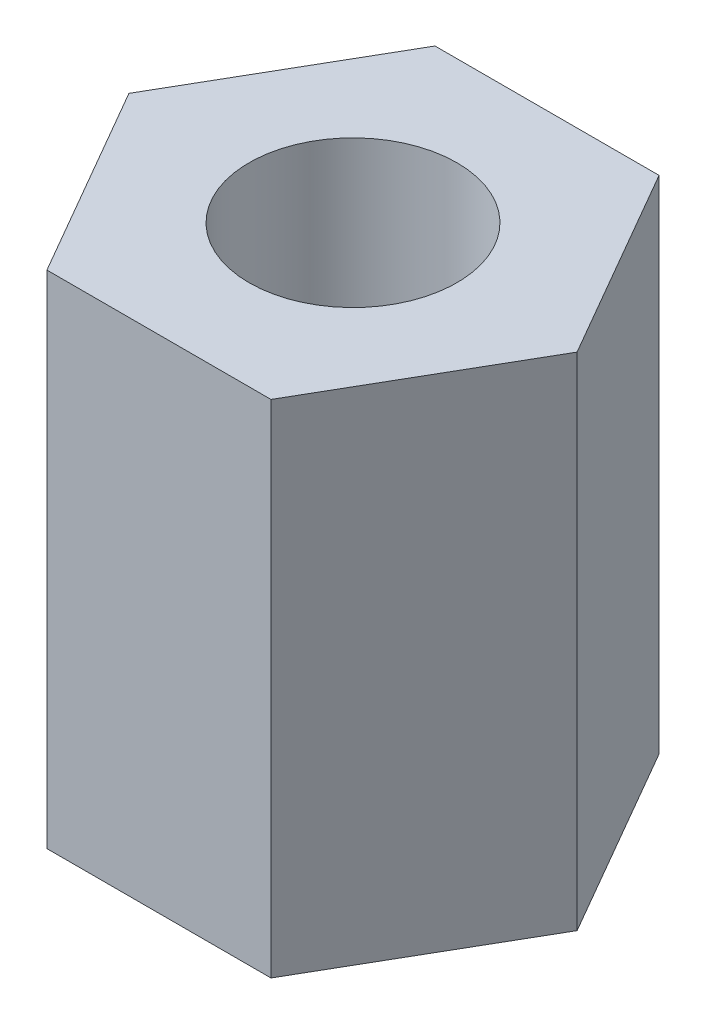
ISO-10303-21;
HEADER;
FILE_DESCRIPTION(('STEP AP214'),'2;1');
FILE_NAME('part.step','',(''),(''),'','','');
FILE_SCHEMA(('AUTOMOTIVE_DESIGN { 1 0 10303 214 1 1 1 1 }'));
ENDSEC;
DATA;
#1=APPLICATION_CONTEXT('core data for automotive mechanical design processes');
#2=APPLICATION_PROTOCOL_DEFINITION('international standard','automotive_design',2000,#1);
#3=PRODUCT_CONTEXT('',#1,'mechanical');
#4=PRODUCT('Part','Part','',(#3));
#5=PRODUCT_RELATED_PRODUCT_CATEGORY('part','',(#4));
#6=PRODUCT_DEFINITION_FORMATION('','',#4);
#7=PRODUCT_DEFINITION_CONTEXT('part definition',#1,'design');
#8=PRODUCT_DEFINITION('design','',#6,#7);
#9=PRODUCT_DEFINITION_SHAPE('','',#8);
#10=(LENGTH_UNIT() NAMED_UNIT(*) SI_UNIT(.MILLI.,.METRE.));
#11=(NAMED_UNIT(*) PLANE_ANGLE_UNIT() SI_UNIT($,.RADIAN.));
#12=(NAMED_UNIT(*) SI_UNIT($,.STERADIAN.) SOLID_ANGLE_UNIT());
#13=UNCERTAINTY_MEASURE_WITH_UNIT(LENGTH_MEASURE(1.E-05),#10,'distance_accuracy_value','');
#14=(GEOMETRIC_REPRESENTATION_CONTEXT(3) GLOBAL_UNCERTAINTY_ASSIGNED_CONTEXT((#13)) GLOBAL_UNIT_ASSIGNED_CONTEXT((#10,
#11,#12)) REPRESENTATION_CONTEXT('',''));
#15=CARTESIAN_POINT('',(0.,0.,0.));
#16=DIRECTION('',(0.,0.,1.));
#17=DIRECTION('',(1.,0.,0.));
#18=AXIS2_PLACEMENT_3D('',#15,#16,#17);
#19=CARTESIAN_POINT('',(0.,7.23,0.));
#20=DIRECTION('',(0.,1.,0.));
#21=DIRECTION('',(0.,0.,1.));
#22=AXIS2_PLACEMENT_3D('',#19,#20,#21);
#23=PLANE('',#22);
#24=DIRECTION('',(0.5,0.,-0.866025403784439));
#25=VECTOR('',#24,1.);
#26=CARTESIAN_POINT('',(1.61658075373095,7.23,2.8));
#27=LINE('',#26,#25);
#28=CARTESIAN_POINT('',(1.61658075373095,7.23,2.8));
#29=VERTEX_POINT('',#28);
#30=CARTESIAN_POINT('',(3.2331615074619,7.23,0.));
#31=VERTEX_POINT('',#30);
#32=EDGE_CURVE('E146',#29,#31,#27,.T.);
#33=ORIENTED_EDGE('',*,*,#32,.T.);
#34=DIRECTION('',(-0.5,0.,-0.866025403784438));
#35=VECTOR('',#34,1.);
#36=CARTESIAN_POINT('',(3.2331615074619,7.23,0.));
#37=LINE('',#36,#35);
#38=CARTESIAN_POINT('',(1.61658075373095,7.23,-2.8));
#39=VERTEX_POINT('',#38);
#40=EDGE_CURVE('E94',#31,#39,#37,.T.);
#41=ORIENTED_EDGE('',*,*,#40,.T.);
#42=DIRECTION('',(-1.,0.,0.));
#43=VECTOR('',#42,1.);
#44=CARTESIAN_POINT('',(1.61658075373095,7.23,-2.8));
#45=LINE('',#44,#43);
#46=CARTESIAN_POINT('',(-1.61658075373095,7.23,-2.8));
#47=VERTEX_POINT('',#46);
#48=EDGE_CURVE('E107',#39,#47,#45,.T.);
#49=ORIENTED_EDGE('',*,*,#48,.T.);
#50=DIRECTION('',(-0.5,0.,0.866025403784438));
#51=VECTOR('',#50,1.);
#52=CARTESIAN_POINT('',(-1.61658075373095,7.23,-2.8));
#53=LINE('',#52,#51);
#54=CARTESIAN_POINT('',(-3.2331615074619,7.23,0.));
#55=VERTEX_POINT('',#54);
#56=EDGE_CURVE('E101',#47,#55,#53,.T.);
#57=ORIENTED_EDGE('',*,*,#56,.T.);
#58=DIRECTION('',(0.5,0.,0.866025403784438));
#59=VECTOR('',#58,1.);
#60=CARTESIAN_POINT('',(-3.2331615074619,7.23,0.));
#61=LINE('',#60,#59);
#62=CARTESIAN_POINT('',(-1.61658075373095,7.23,2.8));
#63=VERTEX_POINT('',#62);
#64=EDGE_CURVE('E105',#55,#63,#61,.T.);
#65=ORIENTED_EDGE('',*,*,#64,.T.);
#66=DIRECTION('',(1.,0.,0.));
#67=VECTOR('',#66,1.);
#68=CARTESIAN_POINT('',(-1.61658075373095,7.23,2.8));
#69=LINE('',#68,#67);
#70=EDGE_CURVE('E57',#63,#29,#69,.T.);
#71=ORIENTED_EDGE('',*,*,#70,.T.);
#72=EDGE_LOOP('',(#33,#41,#49,#57,#65,#71));
#73=FACE_BOUND('',#72,.T.);
#74=CARTESIAN_POINT('',(0.,7.23,0.));
#75=DIRECTION('',(0.,1.,0.));
#76=DIRECTION('',(0.,0.,1.));
#77=AXIS2_PLACEMENT_3D('',#74,#75,#76);
#78=CIRCLE('',#77,1.5);
#79=CARTESIAN_POINT('',(0.,7.23,1.5));
#80=VERTEX_POINT('',#79);
#81=EDGE_CURVE('E134',#80,#80,#78,.T.);
#82=ORIENTED_EDGE('',*,*,#81,.F.);
#83=EDGE_LOOP('',(#82));
#84=FACE_BOUND('',#83,.T.);
#85=ADVANCED_FACE('F39',(#73,#84),#23,.T.);
#86=CARTESIAN_POINT('',(0.,0.,0.));
#87=DIRECTION('',(0.,1.,0.));
#88=DIRECTION('',(0.,0.,1.));
#89=AXIS2_PLACEMENT_3D('',#86,#87,#88);
#90=PLANE('',#89);
#91=DIRECTION('',(0.5,0.,-0.866025403784439));
#92=VECTOR('',#91,1.);
#93=CARTESIAN_POINT('',(1.61658075373095,0.,2.8));
#94=LINE('',#93,#92);
#95=CARTESIAN_POINT('',(1.61658075373095,0.,2.8));
#96=VERTEX_POINT('',#95);
#97=CARTESIAN_POINT('',(3.2331615074619,0.,0.));
#98=VERTEX_POINT('',#97);
#99=EDGE_CURVE('E129',#96,#98,#94,.T.);
#100=ORIENTED_EDGE('',*,*,#99,.F.);
#101=DIRECTION('',(1.,0.,0.));
#102=VECTOR('',#101,1.);
#103=CARTESIAN_POINT('',(-1.61658075373095,0.,2.8));
#104=LINE('',#103,#102);
#105=CARTESIAN_POINT('',(-1.61658075373095,0.,2.8));
#106=VERTEX_POINT('',#105);
#107=EDGE_CURVE('E86',#106,#96,#104,.T.);
#108=ORIENTED_EDGE('',*,*,#107,.F.);
#109=DIRECTION('',(0.5,0.,0.866025403784438));
#110=VECTOR('',#109,1.);
#111=CARTESIAN_POINT('',(-3.2331615074619,0.,0.));
#112=LINE('',#111,#110);
#113=CARTESIAN_POINT('',(-3.2331615074619,0.,0.));
#114=VERTEX_POINT('',#113);
#115=EDGE_CURVE('E80',#114,#106,#112,.T.);
#116=ORIENTED_EDGE('',*,*,#115,.F.);
#117=DIRECTION('',(-0.5,0.,0.866025403784438));
#118=VECTOR('',#117,1.);
#119=CARTESIAN_POINT('',(-1.61658075373095,0.,-2.8));
#120=LINE('',#119,#118);
#121=CARTESIAN_POINT('',(-1.61658075373095,0.,-2.8));
#122=VERTEX_POINT('',#121);
#123=EDGE_CURVE('E116',#122,#114,#120,.T.);
#124=ORIENTED_EDGE('',*,*,#123,.F.);
#125=DIRECTION('',(-1.,0.,0.));
#126=VECTOR('',#125,1.);
#127=CARTESIAN_POINT('',(1.61658075373095,0.,-2.8));
#128=LINE('',#127,#126);
#129=CARTESIAN_POINT('',(1.61658075373095,0.,-2.8));
#130=VERTEX_POINT('',#129);
#131=EDGE_CURVE('E137',#130,#122,#128,.T.);
#132=ORIENTED_EDGE('',*,*,#131,.F.);
#133=DIRECTION('',(-0.5,0.,-0.866025403784438));
#134=VECTOR('',#133,1.);
#135=CARTESIAN_POINT('',(3.2331615074619,0.,0.));
#136=LINE('',#135,#134);
#137=EDGE_CURVE('E133',#98,#130,#136,.T.);
#138=ORIENTED_EDGE('',*,*,#137,.F.);
#139=EDGE_LOOP('',(#100,#108,#116,#124,#132,#138));
#140=FACE_BOUND('',#139,.T.);
#141=CARTESIAN_POINT('',(0.,0.,0.));
#142=DIRECTION('',(0.,1.,0.));
#143=DIRECTION('',(0.,0.,1.));
#144=AXIS2_PLACEMENT_3D('',#141,#142,#143);
#145=CIRCLE('',#144,1.5);
#146=CARTESIAN_POINT('',(0.,0.,1.5));
#147=VERTEX_POINT('',#146);
#148=EDGE_CURVE('E243',#147,#147,#145,.T.);
#149=ORIENTED_EDGE('',*,*,#148,.T.);
#150=EDGE_LOOP('',(#149));
#151=FACE_BOUND('',#150,.T.);
#152=ADVANCED_FACE('F159',(#140,#151),#90,.F.);
#153=CARTESIAN_POINT('',(1.61658075373095,7.23,2.8));
#154=DIRECTION('',(-0.866025403784439,0.,-0.5));
#155=DIRECTION('',(-0.5,0.,0.866025403784439));
#156=AXIS2_PLACEMENT_3D('',#153,#154,#155);
#157=PLANE('',#156);
#158=ORIENTED_EDGE('',*,*,#99,.T.);
#159=DIRECTION('',(0.,-1.,0.));
#160=VECTOR('',#159,1.);
#161=CARTESIAN_POINT('',(3.2331615074619,7.23,0.));
#162=LINE('',#161,#160);
#163=EDGE_CURVE('E11',#31,#98,#162,.T.);
#164=ORIENTED_EDGE('',*,*,#163,.F.);
#165=ORIENTED_EDGE('',*,*,#32,.F.);
#166=DIRECTION('',(0.,-1.,0.));
#167=VECTOR('',#166,1.);
#168=CARTESIAN_POINT('',(1.61658075373095,7.23,2.8));
#169=LINE('',#168,#167);
#170=EDGE_CURVE('E125',#29,#96,#169,.T.);
#171=ORIENTED_EDGE('',*,*,#170,.T.);
#172=EDGE_LOOP('',(#158,#164,#165,#171));
#173=FACE_BOUND('',#172,.T.);
#174=ADVANCED_FACE('F41',(#173),#157,.F.);
#175=CARTESIAN_POINT('',(3.2331615074619,7.23,0.));
#176=DIRECTION('',(-0.866025403784438,0.,0.5));
#177=DIRECTION('',(0.5,0.,0.866025403784438));
#178=AXIS2_PLACEMENT_3D('',#175,#176,#177);
#179=PLANE('',#178);
#180=ORIENTED_EDGE('',*,*,#137,.T.);
#181=DIRECTION('',(0.,-1.,0.));
#182=VECTOR('',#181,1.);
#183=CARTESIAN_POINT('',(1.61658075373095,7.23,-2.8));
#184=LINE('',#183,#182);
#185=EDGE_CURVE('E49',#39,#130,#184,.T.);
#186=ORIENTED_EDGE('',*,*,#185,.F.);
#187=ORIENTED_EDGE('',*,*,#40,.F.);
#188=ORIENTED_EDGE('',*,*,#163,.T.);
#189=EDGE_LOOP('',(#180,#186,#187,#188));
#190=FACE_BOUND('',#189,.T.);
#191=ADVANCED_FACE('F184',(#190),#179,.F.);
#192=CARTESIAN_POINT('',(1.61658075373095,7.23,-2.8));
#193=DIRECTION('',(0.,0.,1.));
#194=DIRECTION('',(1.,0.,0.));
#195=AXIS2_PLACEMENT_3D('',#192,#193,#194);
#196=PLANE('',#195);
#197=ORIENTED_EDGE('',*,*,#131,.T.);
#198=DIRECTION('',(0.,-1.,0.));
#199=VECTOR('',#198,1.);
#200=CARTESIAN_POINT('',(-1.61658075373095,7.23,-2.8));
#201=LINE('',#200,#199);
#202=EDGE_CURVE('E118',#47,#122,#201,.T.);
#203=ORIENTED_EDGE('',*,*,#202,.F.);
#204=ORIENTED_EDGE('',*,*,#48,.F.);
#205=ORIENTED_EDGE('',*,*,#185,.T.);
#206=EDGE_LOOP('',(#197,#203,#204,#205));
#207=FACE_BOUND('',#206,.T.);
#208=ADVANCED_FACE('F156',(#207),#196,.F.);
#209=CARTESIAN_POINT('',(-1.61658075373095,7.23,-2.8));
#210=DIRECTION('',(0.866025403784438,0.,0.5));
#211=DIRECTION('',(0.5,0.,-0.866025403784438));
#212=AXIS2_PLACEMENT_3D('',#209,#210,#211);
#213=PLANE('',#212);
#214=ORIENTED_EDGE('',*,*,#123,.T.);
#215=DIRECTION('',(0.,-1.,0.));
#216=VECTOR('',#215,1.);
#217=CARTESIAN_POINT('',(-3.2331615074619,7.23,0.));
#218=LINE('',#217,#216);
#219=EDGE_CURVE('E113',#55,#114,#218,.T.);
#220=ORIENTED_EDGE('',*,*,#219,.F.);
#221=ORIENTED_EDGE('',*,*,#56,.F.);
#222=ORIENTED_EDGE('',*,*,#202,.T.);
#223=EDGE_LOOP('',(#214,#220,#221,#222));
#224=FACE_BOUND('',#223,.T.);
#225=ADVANCED_FACE('F114',(#224),#213,.F.);
#226=CARTESIAN_POINT('',(-3.2331615074619,7.23,0.));
#227=DIRECTION('',(0.866025403784438,0.,-0.5));
#228=DIRECTION('',(-0.5,0.,-0.866025403784438));
#229=AXIS2_PLACEMENT_3D('',#226,#227,#228);
#230=PLANE('',#229);
#231=ORIENTED_EDGE('',*,*,#115,.T.);
#232=DIRECTION('',(0.,-1.,0.));
#233=VECTOR('',#232,1.);
#234=CARTESIAN_POINT('',(-1.61658075373095,7.23,2.8));
#235=LINE('',#234,#233);
#236=EDGE_CURVE('E119',#63,#106,#235,.T.);
#237=ORIENTED_EDGE('',*,*,#236,.F.);
#238=ORIENTED_EDGE('',*,*,#64,.F.);
#239=ORIENTED_EDGE('',*,*,#219,.T.);
#240=EDGE_LOOP('',(#231,#237,#238,#239));
#241=FACE_BOUND('',#240,.T.);
#242=ADVANCED_FACE('F121',(#241),#230,.F.);
#243=CARTESIAN_POINT('',(-1.61658075373095,7.23,2.8));
#244=DIRECTION('',(0.,0.,-1.));
#245=DIRECTION('',(-1.,0.,0.));
#246=AXIS2_PLACEMENT_3D('',#243,#244,#245);
#247=PLANE('',#246);
#248=ORIENTED_EDGE('',*,*,#107,.T.);
#249=ORIENTED_EDGE('',*,*,#170,.F.);
#250=ORIENTED_EDGE('',*,*,#70,.F.);
#251=ORIENTED_EDGE('',*,*,#236,.T.);
#252=EDGE_LOOP('',(#248,#249,#250,#251));
#253=FACE_BOUND('',#252,.T.);
#254=ADVANCED_FACE('F164',(#253),#247,.F.);
#255=CARTESIAN_POINT('',(0.,7.23,0.));
#256=DIRECTION('',(0.,-1.,0.));
#257=DIRECTION('',(0.,0.,-1.));
#258=AXIS2_PLACEMENT_3D('',#255,#256,#257);
#259=CYLINDRICAL_SURFACE('',#258,1.5);
#260=ORIENTED_EDGE('',*,*,#81,.T.);
#261=EDGE_LOOP('',(#260));
#262=FACE_BOUND('',#261,.T.);
#263=ORIENTED_EDGE('',*,*,#148,.F.);
#264=EDGE_LOOP('',(#263));
#265=FACE_BOUND('',#264,.T.);
#266=ADVANCED_FACE('F166',(#262,#265),#259,.F.);
#267=CLOSED_SHELL('',(#85,#152,#174,#191,#208,#225,#242,#254,#266));
#268=MANIFOLD_SOLID_BREP('B2',#267);
#269=ADVANCED_BREP_SHAPE_REPRESENTATION('',(#18,#268),#14);
#270=SHAPE_DEFINITION_REPRESENTATION(#9,#269);
ENDSEC;
END-ISO-10303-21;
